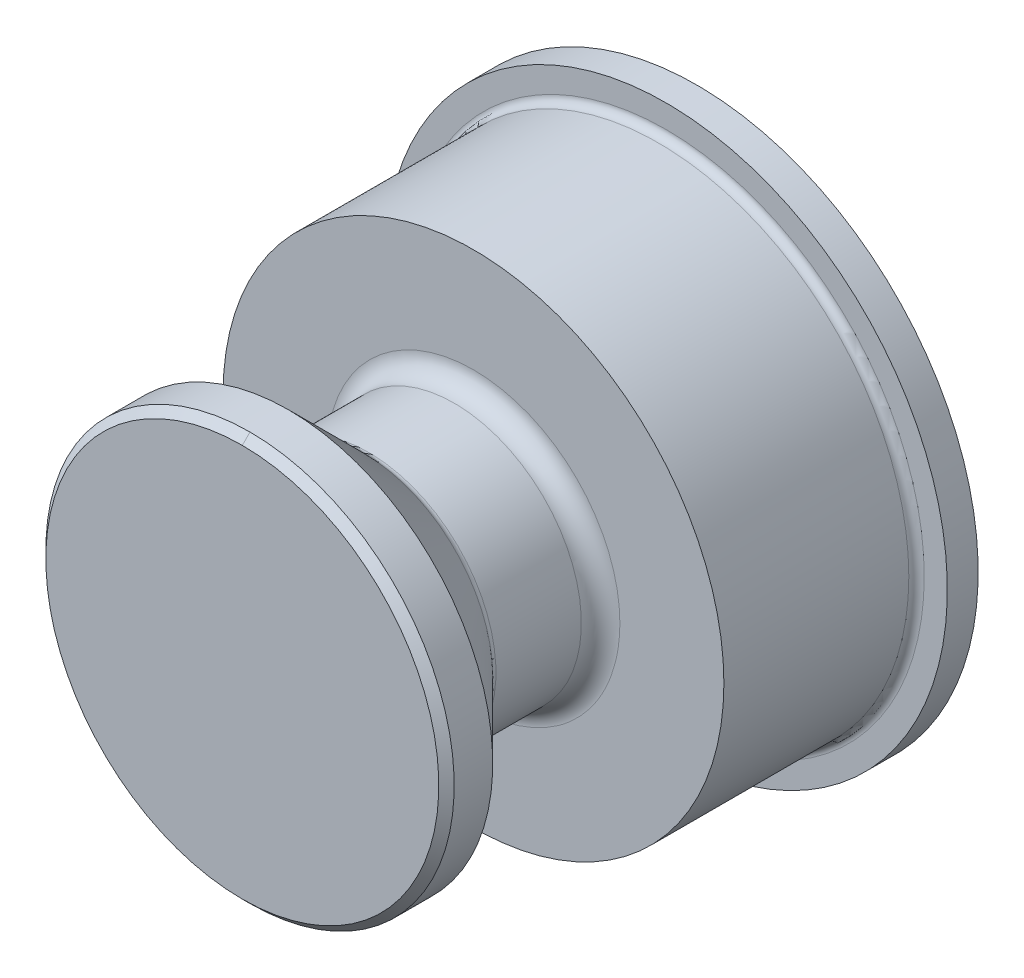
ISO-10303-21;
HEADER;
FILE_DESCRIPTION(('STEP AP214'),'2;1');
FILE_NAME('part.step','',(''),(''),'','','');
FILE_SCHEMA(('AUTOMOTIVE_DESIGN { 1 0 10303 214 1 1 1 1 }'));
ENDSEC;
DATA;
#1=APPLICATION_CONTEXT('core data for automotive mechanical design processes');
#2=APPLICATION_PROTOCOL_DEFINITION('international standard','automotive_design',2000,#1);
#3=PRODUCT_CONTEXT('',#1,'mechanical');
#4=PRODUCT('Part','Part','',(#3));
#5=PRODUCT_RELATED_PRODUCT_CATEGORY('part','',(#4));
#6=PRODUCT_DEFINITION_FORMATION('','',#4);
#7=PRODUCT_DEFINITION_CONTEXT('part definition',#1,'design');
#8=PRODUCT_DEFINITION('design','',#6,#7);
#9=PRODUCT_DEFINITION_SHAPE('','',#8);
#10=(LENGTH_UNIT() NAMED_UNIT(*) SI_UNIT(.MILLI.,.METRE.));
#11=(NAMED_UNIT(*) PLANE_ANGLE_UNIT() SI_UNIT($,.RADIAN.));
#12=(NAMED_UNIT(*) SI_UNIT($,.STERADIAN.) SOLID_ANGLE_UNIT());
#13=UNCERTAINTY_MEASURE_WITH_UNIT(LENGTH_MEASURE(1.E-05),#10,'distance_accuracy_value','');
#14=(GEOMETRIC_REPRESENTATION_CONTEXT(3) GLOBAL_UNCERTAINTY_ASSIGNED_CONTEXT((#13)) GLOBAL_UNIT_ASSIGNED_CONTEXT((#10,
#11,#12)) REPRESENTATION_CONTEXT('',''));
#15=CARTESIAN_POINT('',(0.,0.,0.));
#16=DIRECTION('',(0.,0.,1.));
#17=DIRECTION('',(1.,0.,0.));
#18=AXIS2_PLACEMENT_3D('',#15,#16,#17);
#19=CARTESIAN_POINT('',(0.,2.65,11.8));
#20=DIRECTION('',(0.,0.,1.));
#21=DIRECTION('',(0.,-1.,0.));
#22=AXIS2_PLACEMENT_3D('',#19,#20,#21);
#23=PLANE('',#22);
#24=CARTESIAN_POINT('',(0.,0.,11.7999999999938));
#25=DIRECTION('',(0.,0.,-1.));
#26=DIRECTION('',(0.,1.,0.));
#27=AXIS2_PLACEMENT_3D('',#24,#25,#26);
#28=CIRCLE('',#27,5.10000000008403);
#29=CARTESIAN_POINT('',(0.,-5.10000000008404,11.7999999999654));
#30=VERTEX_POINT('',#29);
#31=CARTESIAN_POINT('',(0.,5.10000000011246,11.7999999999938));
#32=VERTEX_POINT('',#31);
#33=EDGE_CURVE('E69',#30,#32,#28,.T.);
#34=ORIENTED_EDGE('',*,*,#33,.F.);
#35=CARTESIAN_POINT('',(0.,0.,11.7999999999938));
#36=DIRECTION('',(0.,0.,-1.));
#37=DIRECTION('',(0.,1.,0.));
#38=AXIS2_PLACEMENT_3D('',#35,#36,#37);
#39=CIRCLE('',#38,5.1000000000272);
#40=EDGE_CURVE('E71',#32,#30,#39,.T.);
#41=ORIENTED_EDGE('',*,*,#40,.F.);
#42=EDGE_LOOP('',(#34,#41));
#43=FACE_BOUND('',#42,.T.);
#44=ADVANCED_FACE('F17',(#43),#23,.T.);
#45=CARTESIAN_POINT('',(0.,0.,11.600000000044));
#46=DIRECTION('',(0.,0.,-1.));
#47=DIRECTION('',(0.,1.,0.));
#48=AXIS2_PLACEMENT_3D('',#45,#46,#47);
#49=CONICAL_SURFACE('',#48,5.29999999992015,0.785398163255338);
#50=DIRECTION('',(0.,-0.707106781188352,0.707106781184743));
#51=VECTOR('',#50,1.);
#52=CARTESIAN_POINT('',(-6.1109875277453E-11,499000.,-498983.099997453));
#53=LINE('',#52,#51);
#54=CARTESIAN_POINT('',(0.,5.29999999999424,11.6000000000394));
#55=VERTEX_POINT('',#54);
#56=EDGE_CURVE('E76',#32,#55,#53,.F.);
#57=ORIENTED_EDGE('',*,*,#56,.F.);
#58=ORIENTED_EDGE('',*,*,#40,.T.);
#59=DIRECTION('',(0.,0.707106781188352,0.707106781184744));
#60=VECTOR('',#59,1.);
#61=CARTESIAN_POINT('',(0.,-499000.,-498983.099997454));
#62=LINE('',#61,#60);
#63=CARTESIAN_POINT('',(0.,-5.29999999998004,11.6000000000394));
#64=VERTEX_POINT('',#63);
#65=EDGE_CURVE('E84',#64,#30,#62,.T.);
#66=ORIENTED_EDGE('',*,*,#65,.F.);
#67=CARTESIAN_POINT('',(0.,0.,11.6));
#68=DIRECTION('',(0.,0.,-1.));
#69=DIRECTION('',(-1.,0.,0.));
#70=AXIS2_PLACEMENT_3D('',#67,#68,#69);
#71=CIRCLE('',#70,5.3);
#72=EDGE_CURVE('E81',#55,#64,#71,.T.);
#73=ORIENTED_EDGE('',*,*,#72,.F.);
#74=EDGE_LOOP('',(#57,#58,#66,#73));
#75=FACE_BOUND('',#74,.T.);
#76=ADVANCED_FACE('F79',(#75),#49,.T.);
#77=CARTESIAN_POINT('',(0.,0.,11.6000000001577));
#78=DIRECTION('',(0.,0.,-1.));
#79=DIRECTION('',(0.,1.,0.));
#80=AXIS2_PLACEMENT_3D('',#77,#78,#79);
#81=CONICAL_SURFACE('',#80,5.29999999992014,0.78539816339745);
#82=ORIENTED_EDGE('',*,*,#65,.T.);
#83=ORIENTED_EDGE('',*,*,#33,.T.);
#84=ORIENTED_EDGE('',*,*,#56,.T.);
#85=CARTESIAN_POINT('',(0.,0.,11.6));
#86=DIRECTION('',(0.,0.,-1.));
#87=DIRECTION('',(-1.,0.,0.));
#88=AXIS2_PLACEMENT_3D('',#85,#86,#87);
#89=CIRCLE('',#88,5.3);
#90=EDGE_CURVE('E88',#64,#55,#89,.T.);
#91=ORIENTED_EDGE('',*,*,#90,.F.);
#92=EDGE_LOOP('',(#82,#83,#84,#91));
#93=FACE_BOUND('',#92,.T.);
#94=ADVANCED_FACE('F86',(#93),#81,.T.);
#95=CARTESIAN_POINT('',(0.,0.,11.2));
#96=DIRECTION('',(0.,0.,-1.));
#97=DIRECTION('',(-1.,0.,0.));
#98=AXIS2_PLACEMENT_3D('',#95,#96,#97);
#99=CYLINDRICAL_SURFACE('',#98,5.3);
#100=ORIENTED_EDGE('',*,*,#72,.T.);
#101=ORIENTED_EDGE('',*,*,#90,.T.);
#102=EDGE_LOOP('',(#100,#101));
#103=FACE_BOUND('',#102,.T.);
#104=CARTESIAN_POINT('',(0.,0.,10.6000000001245));
#105=DIRECTION('',(0.,0.,1.));
#106=DIRECTION('',(0.,1.,0.));
#107=AXIS2_PLACEMENT_3D('',#104,#105,#106);
#108=CIRCLE('',#107,5.30000000026121);
#109=CARTESIAN_POINT('',(0.,-5.3000000000538,10.599999999954));
#110=VERTEX_POINT('',#109);
#111=CARTESIAN_POINT('',(0.,5.30000000015327,10.6000000001103));
#112=VERTEX_POINT('',#111);
#113=EDGE_CURVE('E238',#110,#112,#108,.F.);
#114=ORIENTED_EDGE('',*,*,#113,.F.);
#115=CARTESIAN_POINT('',(0.,0.,10.599999999954));
#116=DIRECTION('',(0.,0.,1.));
#117=DIRECTION('',(0.,-1.,0.));
#118=AXIS2_PLACEMENT_3D('',#115,#116,#117);
#119=CIRCLE('',#118,5.30000000003383);
#120=EDGE_CURVE('E235',#112,#110,#119,.F.);
#121=ORIENTED_EDGE('',*,*,#120,.F.);
#122=EDGE_LOOP('',(#114,#121));
#123=FACE_BOUND('',#122,.T.);
#124=ADVANCED_FACE('F196',(#103,#123),#99,.T.);
#125=CARTESIAN_POINT('',(0.,0.,10.6000000001245));
#126=DIRECTION('',(0.,0.,1.));
#127=DIRECTION('',(0.,-1.,0.));
#128=AXIS2_PLACEMENT_3D('',#125,#126,#127);
#129=CONICAL_SURFACE('',#128,5.30000000020436,0.785398163397448);
#130=DIRECTION('',(0.,-0.707106781188352,-0.707106781184743));
#131=VECTOR('',#130,1.);
#132=CARTESIAN_POINT('',(0.,498994.700002546,499000.));
#133=LINE('',#132,#131);
#134=CARTESIAN_POINT('',(0.,3.35857864375253,8.65857864375064));
#135=VERTEX_POINT('',#134);
#136=EDGE_CURVE('E245',#112,#135,#133,.T.);
#137=ORIENTED_EDGE('',*,*,#136,.F.);
#138=ORIENTED_EDGE('',*,*,#120,.T.);
#139=DIRECTION('',(0.,0.707106781188352,-0.707106781184743));
#140=VECTOR('',#139,1.);
#141=CARTESIAN_POINT('',(3.82087097872039E-10,-498994.700002547,499000.));
#142=LINE('',#141,#140);
#143=CARTESIAN_POINT('',(0.,-3.35857864378066,8.65857864373817));
#144=VERTEX_POINT('',#143);
#145=EDGE_CURVE('E242',#144,#110,#142,.F.);
#146=ORIENTED_EDGE('',*,*,#145,.F.);
#147=CARTESIAN_POINT('',(0.,0.,8.65857864376231));
#148=DIRECTION('',(0.,0.,-1.));
#149=DIRECTION('',(-1.,0.,0.));
#150=AXIS2_PLACEMENT_3D('',#147,#148,#149);
#151=CIRCLE('',#150,3.35857864375769);
#152=EDGE_CURVE('E241',#144,#135,#151,.F.);
#153=ORIENTED_EDGE('',*,*,#152,.T.);
#154=EDGE_LOOP('',(#137,#138,#146,#153));
#155=FACE_BOUND('',#154,.T.);
#156=ADVANCED_FACE('F192',(#155),#129,.T.);
#157=CARTESIAN_POINT('',(0.,0.,10.6000000001245));
#158=DIRECTION('',(0.,0.,1.));
#159=DIRECTION('',(0.,-1.,0.));
#160=AXIS2_PLACEMENT_3D('',#157,#158,#159);
#161=CONICAL_SURFACE('',#160,5.30000000026121,0.785398163412088);
#162=ORIENTED_EDGE('',*,*,#145,.T.);
#163=ORIENTED_EDGE('',*,*,#113,.T.);
#164=ORIENTED_EDGE('',*,*,#136,.T.);
#165=CARTESIAN_POINT('',(0.,0.,8.65857864376231));
#166=DIRECTION('',(0.,0.,-1.));
#167=DIRECTION('',(-1.,0.,0.));
#168=AXIS2_PLACEMENT_3D('',#165,#166,#167);
#169=CIRCLE('',#168,3.35857864375769);
#170=EDGE_CURVE('E254',#135,#144,#169,.F.);
#171=ORIENTED_EDGE('',*,*,#170,.T.);
#172=EDGE_LOOP('',(#162,#163,#164,#171));
#173=FACE_BOUND('',#172,.T.);
#174=ADVANCED_FACE('F188',(#173),#161,.T.);
#175=CARTESIAN_POINT('',(0.,0.,8.51715728753));
#176=DIRECTION('',(0.,0.,-1.));
#177=DIRECTION('',(-1.,0.,0.));
#178=AXIS2_PLACEMENT_3D('',#175,#176,#177);
#179=TOROIDAL_SURFACE('',#178,3.5,0.2);
#180=CARTESIAN_POINT('',(0.,0.,8.51715728753));
#181=DIRECTION('',(0.,0.,-1.));
#182=DIRECTION('',(-1.,0.,0.));
#183=AXIS2_PLACEMENT_3D('',#180,#181,#182);
#184=CIRCLE('',#183,3.3);
#185=CARTESIAN_POINT('',(-3.3,0.,8.51715728753));
#186=VERTEX_POINT('',#185);
#187=EDGE_CURVE('E179',#186,#186,#184,.T.);
#188=ORIENTED_EDGE('',*,*,#187,.F.);
#189=EDGE_LOOP('',(#188));
#190=FACE_BOUND('',#189,.T.);
#191=ORIENTED_EDGE('',*,*,#152,.F.);
#192=ORIENTED_EDGE('',*,*,#170,.F.);
#193=EDGE_LOOP('',(#191,#192));
#194=FACE_BOUND('',#193,.T.);
#195=ADVANCED_FACE('F184',(#190,#194),#179,.F.);
#196=CARTESIAN_POINT('',(0.,0.,7.2));
#197=DIRECTION('',(0.,0.,-1.));
#198=DIRECTION('',(-1.,0.,0.));
#199=AXIS2_PLACEMENT_3D('',#196,#197,#198);
#200=CYLINDRICAL_SURFACE('',#199,3.3);
#201=ORIENTED_EDGE('',*,*,#187,.T.);
#202=EDGE_LOOP('',(#201));
#203=FACE_BOUND('',#202,.T.);
#204=CARTESIAN_POINT('',(0.,0.,6.29999999963));
#205=DIRECTION('',(0.,0.,-1.));
#206=DIRECTION('',(-1.,0.,0.));
#207=AXIS2_PLACEMENT_3D('',#204,#205,#206);
#208=CIRCLE('',#207,3.3);
#209=CARTESIAN_POINT('',(-3.3,0.,6.29999999963));
#210=VERTEX_POINT('',#209);
#211=EDGE_CURVE('E171',#210,#210,#208,.F.);
#212=ORIENTED_EDGE('',*,*,#211,.T.);
#213=EDGE_LOOP('',(#212));
#214=FACE_BOUND('',#213,.T.);
#215=ADVANCED_FACE('F187',(#203,#214),#200,.T.);
#216=CARTESIAN_POINT('',(0.,0.,6.3));
#217=DIRECTION('',(0.,0.,-1.));
#218=DIRECTION('',(-1.,0.,0.));
#219=AXIS2_PLACEMENT_3D('',#216,#217,#218);
#220=TOROIDAL_SURFACE('',#219,3.8,0.5);
#221=CARTESIAN_POINT('',(0.,0.,5.8));
#222=DIRECTION('',(0.,0.,1.));
#223=DIRECTION('',(1.,0.,0.));
#224=AXIS2_PLACEMENT_3D('',#221,#222,#223);
#225=CIRCLE('',#224,3.8);
#226=CARTESIAN_POINT('',(-3.8,0.,5.8));
#227=VERTEX_POINT('',#226);
#228=CARTESIAN_POINT('',(3.8,0.,5.8));
#229=VERTEX_POINT('',#228);
#230=EDGE_CURVE('E167',#227,#229,#225,.F.);
#231=ORIENTED_EDGE('',*,*,#230,.F.);
#232=CARTESIAN_POINT('',(-3.8,0.,5.8));
#233=CARTESIAN_POINT('',(-3.79998892251981,-0.0398139902608369,5.80000000042836));
#234=CARTESIAN_POINT('',(-3.79935919484048,-0.0796278373166707,5.80000000027159));
#235=CARTESIAN_POINT('',(-3.79686347181752,-0.159216193823115,5.80000000000073));
#236=CARTESIAN_POINT('',(-3.79499749415881,-0.198990703828303,5.79999999988663));
#237=CARTESIAN_POINT('',(-3.79003031040861,-0.278462366357164,5.80000000091398));
#238=CARTESIAN_POINT('',(-3.78692910773533,-0.318159519094603,5.80000000205542));
#239=CARTESIAN_POINT('',(-3.77949723692364,-0.397439028336934,5.80000001600552));
#240=CARTESIAN_POINT('',(-3.77516655800294,-0.437021383832,5.80000002881428));
#241=CARTESIAN_POINT('',(-3.76526954812347,-0.516031982386069,5.80000006226051));
#242=CARTESIAN_POINT('',(-3.75970319207449,-0.555460222299237,5.80000008289815));
#243=CARTESIAN_POINT('',(-3.74737858852138,-0.634130857303341,5.80000019851167));
#244=CARTESIAN_POINT('',(-3.74062030307056,-0.673373246436612,5.80000029348993));
#245=CARTESIAN_POINT('',(-3.72157174740259,-0.773762679350423,5.80000040408748));
#246=CARTESIAN_POINT('',(-3.7083159839561,-0.834730348430268,5.80000034431401));
#247=CARTESIAN_POINT('',(-3.68739018056876,-0.920702348195323,5.80000025760052));
#248=CARTESIAN_POINT('',(-3.68095125111372,-0.946014721269749,5.80000023176813));
#249=CARTESIAN_POINT('',(-3.6664679109504,-1.00056876086413,5.80000017658));
#250=CARTESIAN_POINT('',(-3.65833200657688,-1.029786152822,5.80000014732749));
#251=CARTESIAN_POINT('',(-3.62840023121165,-1.13249731540961,5.80000005895707));
#252=CARTESIAN_POINT('',(-3.60472097566727,-1.20545535004403,5.80000002246842));
#253=CARTESIAN_POINT('',(-3.564330708124,-1.31825742155019,5.80000000081535));
#254=CARTESIAN_POINT('',(-3.54909634262817,-1.35864007683997,5.80000000019077));
#255=CARTESIAN_POINT('',(-3.5173108119944,-1.43883917780284,5.79999999980942));
#256=CARTESIAN_POINT('',(-3.50076099293601,-1.47865615435878,5.80000000005176));
#257=CARTESIAN_POINT('',(-3.46630809901312,-1.55769973921588,5.8000000004703));
#258=CARTESIAN_POINT('',(-3.44840502938294,-1.59692634979987,5.80000000064649));
#259=CARTESIAN_POINT('',(-3.41127767279957,-1.67474909510907,5.80000000107934));
#260=CARTESIAN_POINT('',(-3.39205338993471,-1.71334523178474,5.80000000133601));
#261=CARTESIAN_POINT('',(-3.35230280337138,-1.78986101074386,5.80000000180931));
#262=CARTESIAN_POINT('',(-3.33177650269459,-1.82778065459704,5.80000000202595));
#263=CARTESIAN_POINT('',(-3.2894464296909,-1.90289998959778,5.80000000239217));
#264=CARTESIAN_POINT('',(-3.26764265934046,-1.94009968185912,5.80000000254174));
#265=CARTESIAN_POINT('',(-3.22278263946919,-2.01373601019405,5.80000000274361));
#266=CARTESIAN_POINT('',(-3.19972639091725,-2.05017264685788,5.80000000279591));
#267=CARTESIAN_POINT('',(-3.15238812920711,-2.12224076894806,5.80000000279577));
#268=CARTESIAN_POINT('',(-3.12810611604891,-2.15787225437442,5.80000000274333));
#269=CARTESIAN_POINT('',(-3.07834438159853,-2.22828887575224,5.80000000254202));
#270=CARTESIAN_POINT('',(-3.05286465937986,-2.26307401104898,5.80000000239315));
#271=CARTESIAN_POINT('',(-3.00073696272379,-2.33175771494276,5.80000000202497));
#272=CARTESIAN_POINT('',(-2.97408898647902,-2.36565628216809,5.80000000180565));
#273=CARTESIAN_POINT('',(-2.91965559300449,-2.43252767342321,5.80000000133967));
#274=CARTESIAN_POINT('',(-2.89187017313524,-2.46550049530445,5.80000000109301));
#275=CARTESIAN_POINT('',(-2.83519397421586,-2.53048221518717,5.80000000063281));
#276=CARTESIAN_POINT('',(-2.80630319174576,-2.56249111020571,5.80000000041927));
#277=CARTESIAN_POINT('',(-2.74744979008897,-2.62550818252464,5.80000000010279));
#278=CARTESIAN_POINT('',(-2.71748716675708,-2.656516355954,5.79999999999984));
#279=CARTESIAN_POINT('',(-2.65732293826376,-2.7166964030976,5.80000000000015));
#280=CARTESIAN_POINT('',(-2.6271481593207,-2.7458951023041,5.80000000009808));
#281=CARTESIAN_POINT('',(-2.56588071983959,-2.80324458565191,5.80000000044342));
#282=CARTESIAN_POINT('',(-2.5347891024945,-2.83139648418234,5.80000000069067));
#283=CARTESIAN_POINT('',(-2.47172542110119,-2.88662496996821,5.80000000129142));
#284=CARTESIAN_POINT('',(-2.43975436179308,-2.91370270453671,5.80000000164481));
#285=CARTESIAN_POINT('',(-2.37496973881769,-2.9667566452377,5.80000000241893));
#286=CARTESIAN_POINT('',(-2.3421571407241,-2.99273403044025,5.80000000283959));
#287=CARTESIAN_POINT('',(-2.27572817683582,-3.04356246030714,5.80000000371339));
#288=CARTESIAN_POINT('',(-2.24211273641504,-3.06841471437611,5.80000000416649));
#289=CARTESIAN_POINT('',(-2.17411748016278,-3.11696943710273,5.80000000507441));
#290=CARTESIAN_POINT('',(-2.13973854861968,-3.14067314411097,5.80000000552924));
#291=CARTESIAN_POINT('',(-2.07025633280546,-3.18690872560772,5.80000000641395));
#292=CARTESIAN_POINT('',(-2.03515389087469,-3.2094418659627,5.80000000684387));
#293=CARTESIAN_POINT('',(-1.96426525145666,-3.25331567484442,5.80000000765623));
#294=CARTESIAN_POINT('',(-1.92847985355656,-3.27465763530436,5.80000000803872));
#295=CARTESIAN_POINT('',(-1.85626642591938,-3.31612986619905,5.80000000873775));
#296=CARTESIAN_POINT('',(-1.81983915226007,-3.33626145316179,5.80000000905437));
#297=CARTESIAN_POINT('',(-1.74638357313739,-3.37529515021116,5.80000000960732));
#298=CARTESIAN_POINT('',(-1.70935597953799,-3.39419859992914,5.80000000984374));
#299=CARTESIAN_POINT('',(-1.63474178717203,-3.43075967585093,5.80000001022602));
#300=CARTESIAN_POINT('',(-1.59715585540287,-3.44841866327985,5.80000001037199));
#301=CARTESIAN_POINT('',(-1.5214673900747,-3.4824759152522,5.80000001056723));
#302=CARTESIAN_POINT('',(-1.48336547804586,-3.49887556108867,5.80000001061661));
#303=CARTESIAN_POINT('',(-1.40668778255262,-3.53040068314612,5.80000001061661));
#304=CARTESIAN_POINT('',(-1.36811257460291,-3.54552755918784,5.80000001056734));
#305=CARTESIAN_POINT('',(-1.29053129494372,-3.57449515124334,5.8000000103721));
#306=CARTESIAN_POINT('',(-1.25152575223783,-3.58833728405268,5.80000001022624));
#307=CARTESIAN_POINT('',(-1.17312703857254,-3.61472485755216,5.80000000984395));
#308=CARTESIAN_POINT('',(-1.13373434966289,-3.62727173044896,5.80000000960763));
#309=CARTESIAN_POINT('',(-1.05460475770215,-3.65105971069364,5.80000000905468));
#310=CARTESIAN_POINT('',(-1.0148682893571,-3.6623022640865,5.80000000873814));
#311=CARTESIAN_POINT('',(-0.935094682152246,-3.68347398927347,5.80000000803911));
#312=CARTESIAN_POINT('',(-0.895057930318022,-3.69340461937088,5.80000000765668));
#313=CARTESIAN_POINT('',(-0.814727381070987,-3.71194633633305,5.80000000684433));
#314=CARTESIAN_POINT('',(-0.774433922719054,-3.72055889217403,5.80000000641445));
#315=CARTESIAN_POINT('',(-0.693633616807625,-3.73645974908362,5.80000000552973));
#316=CARTESIAN_POINT('',(-0.653127060114819,-3.74374952821202,5.80000000507492));
#317=CARTESIAN_POINT('',(-0.571944203548813,-3.75700156346981,5.80000000416699));
#318=CARTESIAN_POINT('',(-0.531268146164635,-3.76296530515211,5.80000000371387));
#319=CARTESIAN_POINT('',(-0.449789854071585,-3.77356343558232,5.80000000284008));
#320=CARTESIAN_POINT('',(-0.40898781336855,-3.77819931578268,5.80000000241937));
#321=CARTESIAN_POINT('',(-0.327301077344329,-3.78614131274705,5.80000000164524));
#322=CARTESIAN_POINT('',(-0.286416527398122,-3.78944892528198,5.80000000129174));
#323=CARTESIAN_POINT('',(-0.204607893946146,-3.7947354213859,5.80000000069102));
#324=CARTESIAN_POINT('',(-0.163683907441682,-3.79671580342557,5.80000000044367));
#325=CARTESIAN_POINT('',(-0.0818402381833036,-3.79935017109352,5.80000000009821));
#326=CARTESIAN_POINT('',(-0.0409206030497418,-3.80000565643099,5.79999999999993));
#327=CARTESIAN_POINT('',(0.0548695018820208,-3.7999924154209,5.80000000000009));
#328=CARTESIAN_POINT('',(0.109740744030438,-3.79879612997422,5.80000000017699));
#329=CARTESIAN_POINT('',(0.218808106326907,-3.79405364795852,5.80000000084807));
#330=CARTESIAN_POINT('',(0.273005307745522,-3.79053204592672,5.80000000133893));
#331=CARTESIAN_POINT('',(0.380630107193198,-3.78121892283932,5.80000000259553));
#332=CARTESIAN_POINT('',(0.434059803355846,-3.77545167149963,5.80000000335832));
#333=CARTESIAN_POINT('',(0.540059965001186,-3.76173028846942,5.8000000051184));
#334=CARTESIAN_POINT('',(0.592633526241169,-3.75380005896045,5.80000000611311));
#335=CARTESIAN_POINT('',(0.696838737203151,-3.73583818821986,5.80000000829847));
#336=CARTESIAN_POINT('',(0.748474437760712,-3.72583004371532,5.80000000948691));
#337=CARTESIAN_POINT('',(0.85072757233502,-3.70379986843011,5.80000001202304));
#338=CARTESIAN_POINT('',(0.901349974619489,-3.69180089340968,5.80000001336888));
#339=CARTESIAN_POINT('',(1.00150655036036,-3.66587822383344,5.80000001618501));
#340=CARTESIAN_POINT('',(1.05104656948792,-3.65197711156351,5.80000001765379));
#341=CARTESIAN_POINT('',(1.14897466926268,-3.62234059386529,5.80000002068287));
#342=CARTESIAN_POINT('',(1.19736943273935,-3.6066272675362,5.80000002224199));
#343=CARTESIAN_POINT('',(1.29294945525378,-3.57345764051193,5.8000000254207));
#344=CARTESIAN_POINT('',(1.34014219345561,-3.55602288880651,5.80000002703942));
#345=CARTESIAN_POINT('',(1.43326660480079,-3.51950227508922,5.80000003030815));
#346=CARTESIAN_POINT('',(1.47920651234136,-3.50043740775442,5.80000003195759));
#347=CARTESIAN_POINT('',(1.569779557451,-3.46074864390242,5.80000003526047));
#348=CARTESIAN_POINT('',(1.61442164338464,-3.44014516620407,5.80000003691364));
#349=CARTESIAN_POINT('',(1.70235903248657,-3.3974711710647,5.80000004019851));
#350=CARTESIAN_POINT('',(1.74566395670891,-3.37542047762456,5.80000004183024));
#351=CARTESIAN_POINT('',(1.83089252690824,-3.32994365940537,5.80000004504868));
#352=CARTESIAN_POINT('',(1.87282642546973,-3.30653674735878,5.80000004663569));
#353=CARTESIAN_POINT('',(1.95528378139118,-3.25843844930698,5.80000004974301));
#354=CARTESIAN_POINT('',(1.99581808195144,-3.23376565074331,5.80000005126387));
#355=CARTESIAN_POINT('',(2.07545221821176,-3.18322563523654,5.80000005421908));
#356=CARTESIAN_POINT('',(2.11456344717356,-3.15737636876415,5.80000005565424));
#357=CARTESIAN_POINT('',(2.19133235559355,-3.10457233942341,5.80000005842009));
#358=CARTESIAN_POINT('',(2.22900193828853,-3.07763488062878,5.80000005975183));
#359=CARTESIAN_POINT('',(2.30287320254526,-3.02274204191656,5.8000000622948));
#360=CARTESIAN_POINT('',(2.33908725779951,-2.99480331241167,5.8000000635073));
#361=CARTESIAN_POINT('',(2.41003763809712,-2.9379939660382,5.80000006579758));
#362=CARTESIAN_POINT('',(2.44478676842714,-2.90913934072549,5.80000006687686));
#363=CARTESIAN_POINT('',(2.51280177861608,-2.85058251806196,5.80000006888839));
#364=CARTESIAN_POINT('',(2.54608085723483,-2.82089565018712,5.80000006982232));
#365=CARTESIAN_POINT('',(2.61115433666575,-2.76075677977538,5.80000007153274));
#366=CARTESIAN_POINT('',(2.6429622924052,-2.73031944328757,5.80000007231108));
#367=CARTESIAN_POINT('',(2.70509597465863,-2.66876005243685,5.80000007370177));
#368=CARTESIAN_POINT('',(2.73543557584392,-2.6376520011278,5.80000007431613));
#369=CARTESIAN_POINT('',(2.79463865632896,-2.574829450514,5.80000007537218));
#370=CARTESIAN_POINT('',(2.82351629456263,-2.54312829338047,5.80000007581603));
#371=CARTESIAN_POINT('',(2.87980499884532,-2.47919554346069,5.80000007652627));
#372=CARTESIAN_POINT('',(2.90723047360376,-2.4469766356595,5.80000007679495));
#373=CARTESIAN_POINT('',(2.96062762814278,-2.38208204377042,5.80000007715193));
#374=CARTESIAN_POINT('',(2.98661393296151,-2.34941839266362,5.80000007724262));
#375=CARTESIAN_POINT('',(3.03714853993976,-2.28370553920137,5.80000007724262));
#376=CARTESIAN_POINT('',(3.06171165109691,-2.25066772439978,5.80000007715439));
#377=CARTESIAN_POINT('',(3.10941846835194,-2.18427526798469,5.8000000767974));
#378=CARTESIAN_POINT('',(3.13257713615411,-2.15093137635667,5.80000007653117));
#379=CARTESIAN_POINT('',(3.17749626508563,-2.08399293221361,5.80000007582092));
#380=CARTESIAN_POINT('',(3.19927181049283,-2.05040850122917,5.80000007537947));
#381=CARTESIAN_POINT('',(3.24144828735832,-1.98305255762332,5.80000007432341));
#382=CARTESIAN_POINT('',(3.26186439676211,-1.94929054811091,5.80000007371138));
#383=CARTESIAN_POINT('',(3.30134780946189,-1.88164036029296,5.80000007232069));
#384=CARTESIAN_POINT('',(3.32043035638684,-1.84776107844079,5.80000007154457));
#385=CARTESIAN_POINT('',(3.35727441077182,-1.77993475487994,5.80000006983416));
#386=CARTESIAN_POINT('',(3.3750512016813,-1.74599601303795,5.80000006890235));
#387=CARTESIAN_POINT('',(3.40931351897652,-1.67810600332414,5.80000006689079));
#388=CARTESIAN_POINT('',(3.42581434049094,-1.64416245940223,5.80000006581346));
#389=CARTESIAN_POINT('',(3.457555461635,-1.57631732340259,5.80000006352327));
#390=CARTESIAN_POINT('',(3.4728110539714,-1.54242286468003,5.80000006231272));
#391=CARTESIAN_POINT('',(3.51639612382154,-1.4416625836648,5.80000005852748));
#392=CARTESIAN_POINT('',(3.54331822547009,-1.37418108059787,5.80000005575286));
#393=CARTESIAN_POINT('',(3.59246580060479,-1.23993568489251,5.80000004984237));
#394=CARTESIAN_POINT('',(3.6148123178228,-1.17321592667191,5.8000000467206));
#395=CARTESIAN_POINT('',(3.65510493914719,-1.04082289659365,5.80000004028354));
#396=CARTESIAN_POINT('',(3.67317033056803,-0.975185949988626,5.80000003697783));
#397=CARTESIAN_POINT('',(3.70520506929096,-0.845254428204282,5.800000030372));
#398=CARTESIAN_POINT('',(3.71929149737436,-0.780988690091063,5.80000002707541));
#399=CARTESIAN_POINT('',(3.74368071909098,-0.654055430043864,5.80000002071752));
#400=CARTESIAN_POINT('',(3.75409787826582,-0.59140986719748,5.80000001765202));
#401=CARTESIAN_POINT('',(3.77146433858788,-0.467936969823002,5.80000001202054));
#402=CARTESIAN_POINT('',(3.77852487620347,-0.407125263048297,5.80000000944056));
#403=CARTESIAN_POINT('',(3.78949361254762,-0.287505849785363,5.80000000506597));
#404=CARTESIAN_POINT('',(3.79350957824233,-0.22870800850472,5.80000000324566));
#405=CARTESIAN_POINT('',(3.79870339528826,-0.1132704111573,5.80000000074485));
#406=CARTESIAN_POINT('',(3.79998519106909,-0.0566353157598622,5.80000000002293));
#407=CARTESIAN_POINT('',(3.8,0.,5.8));
#408=B_SPLINE_CURVE_WITH_KNOTS('',3,(#232,#233,#234,#235,#236,#237,#238,#239,#240,#241,#242,
#243,#244,#245,#246,#247,#248,#249,#250,#251,#252,#253,#254,#255,#256,#257,#258,#259,#260,#261,
#262,#263,#264,#265,#266,#267,#268,#269,#270,#271,#272,#273,#274,#275,#276,#277,#278,#279,#280,
#281,#282,#283,#284,#285,#286,#287,#288,#289,#290,#291,#292,#293,#294,#295,#296,#297,#298,#299,
#300,#301,#302,#303,#304,#305,#306,#307,#308,#309,#310,#311,#312,#313,#314,#315,#316,#317,#318,
#319,#320,#321,#322,#323,#324,#325,#326,#327,#328,#329,#330,#331,#332,#333,#334,#335,#336,#337,
#338,#339,#340,#341,#342,#343,#344,#345,#346,#347,#348,#349,#350,#351,#352,#353,#354,#355,#356,
#357,#358,#359,#360,#361,#362,#363,#364,#365,#366,#367,#368,#369,#370,#371,#372,#373,#374,#375,
#376,#377,#378,#379,#380,#381,#382,#383,#384,#385,#386,#387,#388,#389,#390,#391,#392,#393,#394,
#395,#396,#397,#398,#399,#400,#401,#402,#403,#404,#405,#406,#407),.UNSPECIFIED.,.F.,.F.,(4,2,2,
2,2,2,2,2,2,2,2,2,2,2,2,2,2,2,2,2,2,2,2,2,2,2,2,2,2,2,2,2,2,2,2,2,2,2,2,2,2,2,2,2,2,2,2,2,2,2,2,
2,2,2,2,2,2,2,2,2,2,2,2,2,2,2,2,2,2,2,2,2,2,2,2,2,2,2,2,2,2,2,2,2,2,2,2,4),(0.,
0.119437234062188,0.238872759577013,0.358307954582117,0.477744197045173,0.597182864862538,
0.716625335857575,0.903703391394023,0.982055051151722,1.07303558203909,1.3029812726911,
1.43244463006643,1.56177717456177,1.6911092188284,1.82044086291207,1.9497722068585,
2.07910335071345,2.20843439452265,2.33776543833186,2.4670965821868,2.59642792613323,
2.7257595702169,2.85509161448353,2.98442415897887,3.11036838017785,3.23617444514066,
3.36184230536671,3.48737191251215,3.61276321838993,3.73801617496976,3.86313073437814,
3.98810684889834,4.11294447097039,4.23764355319112,4.36220404831412,4.48662590924977,
4.61090908906522,4.73505354098439,4.859059218388,4.98292607481353,5.10665406395525,
5.23024313966419,5.35369325594818,5.47700436697183,5.6001764270565,5.72320939068037,
5.84610321247839,5.96885784724227,6.1334567329189,6.29634198317092,6.45751365066369,
6.616971786845,6.77471644194506,6.93074766497652,7.0850655037344,7.23767000479613,
7.38856121352155,7.53773917405285,7.68520392931463,7.83095552101383,7.97499398963978,
8.11731937446416,8.25793171354102,8.39683104370674,8.53401740058008,8.66949081856215,
8.80325133083638,8.9352989693686,9.06563376490695,9.19425574698196,9.3211649439065,
9.44636138277581,9.56984508946749,9.69161608864154,9.81167440374033,9.93002005698863,
10.0466530693936,10.1615734607449,10.2747812496144,10.3862764533568,10.6041068065492,
10.8150890426857,11.0192231281437,11.2165090140012,11.4069466360382,11.5905359147373,
11.7672767552854,11.9371690475756),.UNSPECIFIED.);
#409=EDGE_CURVE('E135',#229,#227,#408,.F.);
#410=ORIENTED_EDGE('',*,*,#409,.F.);
#411=EDGE_LOOP('',(#231,#410));
#412=FACE_BOUND('',#411,.T.);
#413=ORIENTED_EDGE('',*,*,#211,.F.);
#414=EDGE_LOOP('',(#413));
#415=FACE_BOUND('',#414,.T.);
#416=ADVANCED_FACE('F148',(#412,#415),#220,.F.);
#417=CARTESIAN_POINT('',(0.,4.9,5.8));
#418=DIRECTION('',(0.,0.,1.));
#419=DIRECTION('',(0.,-1.,0.));
#420=AXIS2_PLACEMENT_3D('',#417,#418,#419);
#421=PLANE('',#420);
#422=ORIENTED_EDGE('',*,*,#409,.T.);
#423=ORIENTED_EDGE('',*,*,#230,.T.);
#424=EDGE_LOOP('',(#422,#423));
#425=FACE_BOUND('',#424,.T.);
#426=CARTESIAN_POINT('',(0.,0.,5.8));
#427=DIRECTION('',(0.,0.,-1.));
#428=DIRECTION('',(-1.,0.,0.));
#429=AXIS2_PLACEMENT_3D('',#426,#427,#428);
#430=CIRCLE('',#429,6.5);
#431=CARTESIAN_POINT('',(-6.5,0.,5.8));
#432=VERTEX_POINT('',#431);
#433=EDGE_CURVE('E92',#432,#432,#430,.T.);
#434=ORIENTED_EDGE('',*,*,#433,.F.);
#435=EDGE_LOOP('',(#434));
#436=FACE_BOUND('',#435,.T.);
#437=ADVANCED_FACE('F140',(#425,#436),#421,.T.);
#438=CARTESIAN_POINT('',(0.,0.,3.3));
#439=DIRECTION('',(0.,0.,-1.));
#440=DIRECTION('',(-1.,0.,0.));
#441=AXIS2_PLACEMENT_3D('',#438,#439,#440);
#442=CYLINDRICAL_SURFACE('',#441,6.5);
#443=CARTESIAN_POINT('',(0.,0.,0.999999999999999));
#444=DIRECTION('',(0.,0.,-1.));
#445=DIRECTION('',(-1.,0.,0.));
#446=AXIS2_PLACEMENT_3D('',#443,#444,#445);
#447=CIRCLE('',#446,6.5);
#448=CARTESIAN_POINT('',(-6.5,0.,0.999999999999999));
#449=VERTEX_POINT('',#448);
#450=EDGE_CURVE('E156',#449,#449,#447,.F.);
#451=ORIENTED_EDGE('',*,*,#450,.T.);
#452=EDGE_LOOP('',(#451));
#453=FACE_BOUND('',#452,.T.);
#454=ORIENTED_EDGE('',*,*,#433,.T.);
#455=EDGE_LOOP('',(#454));
#456=FACE_BOUND('',#455,.T.);
#457=ADVANCED_FACE('F112',(#453,#456),#442,.T.);
#458=CARTESIAN_POINT('',(0.,0.,1.));
#459=DIRECTION('',(0.,0.,-1.));
#460=DIRECTION('',(-1.,0.,0.));
#461=AXIS2_PLACEMENT_3D('',#458,#459,#460);
#462=TOROIDAL_SURFACE('',#461,6.7,0.2);
#463=CARTESIAN_POINT('',(0.,0.,0.8));
#464=DIRECTION('',(0.,0.,1.));
#465=DIRECTION('',(1.,0.,0.));
#466=AXIS2_PLACEMENT_3D('',#463,#464,#465);
#467=CIRCLE('',#466,6.7);
#468=CARTESIAN_POINT('',(-6.7,0.,0.799999999999999));
#469=VERTEX_POINT('',#468);
#470=CARTESIAN_POINT('',(6.7,0.,0.799999999999999));
#471=VERTEX_POINT('',#470);
#472=EDGE_CURVE('E36',#469,#471,#467,.F.);
#473=ORIENTED_EDGE('',*,*,#472,.F.);
#474=CARTESIAN_POINT('',(0.,0.,0.8));
#475=DIRECTION('',(0.,0.,1.));
#476=DIRECTION('',(-1.,0.,0.));
#477=AXIS2_PLACEMENT_3D('',#474,#475,#476);
#478=CIRCLE('',#477,6.7);
#479=EDGE_CURVE('E96',#471,#469,#478,.F.);
#480=ORIENTED_EDGE('',*,*,#479,.F.);
#481=EDGE_LOOP('',(#473,#480));
#482=FACE_BOUND('',#481,.T.);
#483=ORIENTED_EDGE('',*,*,#450,.F.);
#484=EDGE_LOOP('',(#483));
#485=FACE_BOUND('',#484,.T.);
#486=ADVANCED_FACE('F100',(#482,#485),#462,.F.);
#487=CARTESIAN_POINT('',(0.,6.9,0.8));
#488=DIRECTION('',(0.,0.,1.));
#489=DIRECTION('',(0.,-1.,0.));
#490=AXIS2_PLACEMENT_3D('',#487,#488,#489);
#491=PLANE('',#490);
#492=ORIENTED_EDGE('',*,*,#479,.T.);
#493=ORIENTED_EDGE('',*,*,#472,.T.);
#494=EDGE_LOOP('',(#492,#493));
#495=FACE_BOUND('',#494,.T.);
#496=CARTESIAN_POINT('',(0.,0.,0.8));
#497=DIRECTION('',(0.,0.,-1.));
#498=DIRECTION('',(-1.,0.,0.));
#499=AXIS2_PLACEMENT_3D('',#496,#497,#498);
#500=CIRCLE('',#499,7.3);
#501=CARTESIAN_POINT('',(-7.3,0.,0.8));
#502=VERTEX_POINT('',#501);
#503=EDGE_CURVE('E28',#502,#502,#500,.T.);
#504=ORIENTED_EDGE('',*,*,#503,.F.);
#505=EDGE_LOOP('',(#504));
#506=FACE_BOUND('',#505,.T.);
#507=ADVANCED_FACE('F111',(#495,#506),#491,.T.);
#508=CARTESIAN_POINT('',(0.,0.,0.4));
#509=DIRECTION('',(0.,0.,-1.));
#510=DIRECTION('',(-1.,0.,0.));
#511=AXIS2_PLACEMENT_3D('',#508,#509,#510);
#512=CYLINDRICAL_SURFACE('',#511,7.3);
#513=ORIENTED_EDGE('',*,*,#503,.T.);
#514=EDGE_LOOP('',(#513));
#515=FACE_BOUND('',#514,.T.);
#516=CARTESIAN_POINT('',(0.,0.,0.));
#517=DIRECTION('',(0.,0.,-1.));
#518=DIRECTION('',(-1.,0.,0.));
#519=AXIS2_PLACEMENT_3D('',#516,#517,#518);
#520=CIRCLE('',#519,7.3);
#521=CARTESIAN_POINT('',(-7.3,0.,0.));
#522=VERTEX_POINT('',#521);
#523=EDGE_CURVE('E11',#522,#522,#520,.T.);
#524=ORIENTED_EDGE('',*,*,#523,.F.);
#525=EDGE_LOOP('',(#524));
#526=FACE_BOUND('',#525,.T.);
#527=ADVANCED_FACE('F209',(#515,#526),#512,.T.);
#528=CARTESIAN_POINT('',(0.,3.65,0.));
#529=DIRECTION('',(0.,0.,-1.));
#530=DIRECTION('',(0.,1.,0.));
#531=AXIS2_PLACEMENT_3D('',#528,#529,#530);
#532=PLANE('',#531);
#533=ORIENTED_EDGE('',*,*,#523,.T.);
#534=EDGE_LOOP('',(#533));
#535=FACE_BOUND('',#534,.T.);
#536=ADVANCED_FACE('F207',(#535),#532,.T.);
#537=CLOSED_SHELL('',(#44,#76,#94,#124,#156,#174,#195,#215,#416,#437,#457,#486,#507,#527,#536));
#538=MANIFOLD_SOLID_BREP('B1',#537);
#539=ADVANCED_BREP_SHAPE_REPRESENTATION('',(#18,#538),#14);
#540=SHAPE_DEFINITION_REPRESENTATION(#9,#539);
ENDSEC;
END-ISO-10303-21;
